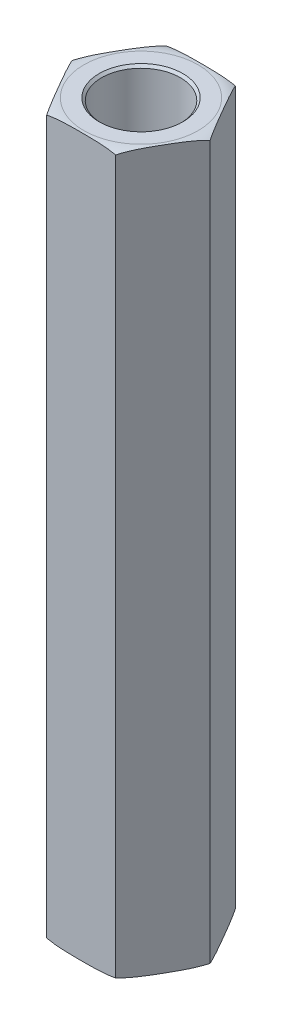
ISO-10303-21;
HEADER;
FILE_DESCRIPTION(('STEP AP214'),'2;1');
FILE_NAME('part.step','',(''),(''),'','','');
FILE_SCHEMA(('AUTOMOTIVE_DESIGN { 1 0 10303 214 1 1 1 1 }'));
ENDSEC;
DATA;
#1=APPLICATION_CONTEXT('core data for automotive mechanical design processes');
#2=APPLICATION_PROTOCOL_DEFINITION('international standard','automotive_design',2000,#1);
#3=PRODUCT_CONTEXT('',#1,'mechanical');
#4=PRODUCT('Part','Part','',(#3));
#5=PRODUCT_RELATED_PRODUCT_CATEGORY('part','',(#4));
#6=PRODUCT_DEFINITION_FORMATION('','',#4);
#7=PRODUCT_DEFINITION_CONTEXT('part definition',#1,'design');
#8=PRODUCT_DEFINITION('design','',#6,#7);
#9=PRODUCT_DEFINITION_SHAPE('','',#8);
#10=(LENGTH_UNIT() NAMED_UNIT(*) SI_UNIT(.MILLI.,.METRE.));
#11=(NAMED_UNIT(*) PLANE_ANGLE_UNIT() SI_UNIT($,.RADIAN.));
#12=(NAMED_UNIT(*) SI_UNIT($,.STERADIAN.) SOLID_ANGLE_UNIT());
#13=UNCERTAINTY_MEASURE_WITH_UNIT(LENGTH_MEASURE(1.E-05),#10,'distance_accuracy_value','');
#14=(GEOMETRIC_REPRESENTATION_CONTEXT(3) GLOBAL_UNCERTAINTY_ASSIGNED_CONTEXT((#13)) GLOBAL_UNIT_ASSIGNED_CONTEXT((#10,
#11,#12)) REPRESENTATION_CONTEXT('',''));
#15=CARTESIAN_POINT('',(0.,0.,0.));
#16=DIRECTION('',(0.,0.,1.));
#17=DIRECTION('',(1.,0.,0.));
#18=AXIS2_PLACEMENT_3D('',#15,#16,#17);
#19=CARTESIAN_POINT('',(0.,6.35,0.));
#20=DIRECTION('',(0.,1.,0.));
#21=DIRECTION('',(0.,0.,1.));
#22=AXIS2_PLACEMENT_3D('',#19,#20,#21);
#23=PLANE('',#22);
#24=CARTESIAN_POINT('',(0.,6.35,0.));
#25=DIRECTION('',(0.,1.,0.));
#26=DIRECTION('',(0.,0.,1.));
#27=AXIS2_PLACEMENT_3D('',#24,#25,#26);
#28=CIRCLE('',#27,2.0955);
#29=CARTESIAN_POINT('',(0.,6.35,2.0955));
#30=VERTEX_POINT('',#29);
#31=EDGE_CURVE('E476',#30,#30,#28,.T.);
#32=ORIENTED_EDGE('',*,*,#31,.T.);
#33=EDGE_LOOP('',(#32));
#34=FACE_BOUND('',#33,.T.);
#35=ADVANCED_FACE('F16',(#34),#23,.T.);
#36=CARTESIAN_POINT('',(0.,-6.35,0.));
#37=DIRECTION('',(0.,-1.,0.));
#38=DIRECTION('',(0.,0.,-1.));
#39=AXIS2_PLACEMENT_3D('',#36,#37,#38);
#40=PLANE('',#39);
#41=CARTESIAN_POINT('',(0.,-6.35,0.));
#42=DIRECTION('',(0.,-1.,0.));
#43=DIRECTION('',(0.,0.,-1.));
#44=AXIS2_PLACEMENT_3D('',#41,#42,#43);
#45=CIRCLE('',#44,2.0955);
#46=CARTESIAN_POINT('',(0.,-6.35,-2.0955));
#47=VERTEX_POINT('',#46);
#48=EDGE_CURVE('E132',#47,#47,#45,.T.);
#49=ORIENTED_EDGE('',*,*,#48,.T.);
#50=EDGE_LOOP('',(#49));
#51=FACE_BOUND('',#50,.T.);
#52=ADVANCED_FACE('F416',(#51),#40,.T.);
#53=CARTESIAN_POINT('',(0.,6.35,0.));
#54=DIRECTION('',(0.,1.,0.));
#55=DIRECTION('',(0.,0.,1.));
#56=AXIS2_PLACEMENT_3D('',#53,#54,#55);
#57=CYLINDRICAL_SURFACE('',#56,2.0955);
#58=CARTESIAN_POINT('',(0.,18.9229999999725,0.));
#59=DIRECTION('',(0.,1.,0.));
#60=DIRECTION('',(0.,0.,1.));
#61=AXIS2_PLACEMENT_3D('',#58,#59,#60);
#62=CIRCLE('',#61,2.09549999999581);
#63=CARTESIAN_POINT('',(0.,18.9229999999725,2.09549999999581));
#64=VERTEX_POINT('',#63);
#65=EDGE_CURVE('E130',#64,#64,#62,.T.);
#66=ORIENTED_EDGE('',*,*,#65,.T.);
#67=EDGE_LOOP('',(#66));
#68=FACE_BOUND('',#67,.T.);
#69=ORIENTED_EDGE('',*,*,#31,.F.);
#70=EDGE_LOOP('',(#69));
#71=FACE_BOUND('',#70,.T.);
#72=ADVANCED_FACE('F407',(#68,#71),#57,.F.);
#73=CARTESIAN_POINT('',(0.,-6.35,0.));
#74=DIRECTION('',(0.,-1.,0.));
#75=DIRECTION('',(0.,0.,-1.));
#76=AXIS2_PLACEMENT_3D('',#73,#74,#75);
#77=CYLINDRICAL_SURFACE('',#76,2.0955);
#78=ORIENTED_EDGE('',*,*,#48,.F.);
#79=EDGE_LOOP('',(#78));
#80=FACE_BOUND('',#79,.T.);
#81=CARTESIAN_POINT('',(0.,-18.9229999999725,0.));
#82=DIRECTION('',(0.,-1.,0.));
#83=DIRECTION('',(0.,0.,-1.));
#84=AXIS2_PLACEMENT_3D('',#81,#82,#83);
#85=CIRCLE('',#84,2.09550000005265);
#86=CARTESIAN_POINT('',(0.,-18.9229999999725,-2.09550000005265));
#87=VERTEX_POINT('',#86);
#88=EDGE_CURVE('E92',#87,#87,#85,.T.);
#89=ORIENTED_EDGE('',*,*,#88,.T.);
#90=EDGE_LOOP('',(#89));
#91=FACE_BOUND('',#90,.T.);
#92=ADVANCED_FACE('F398',(#80,#91),#77,.F.);
#93=CARTESIAN_POINT('',(0.,19.0499999999361,0.));
#94=DIRECTION('',(0.,1.,0.));
#95=DIRECTION('',(0.,0.,1.));
#96=AXIS2_PLACEMENT_3D('',#93,#94,#95);
#97=CONICAL_SURFACE('',#96,2.22249999995938,0.785398163397448);
#98=CARTESIAN_POINT('',(0.,19.0499999999929,0.));
#99=DIRECTION('',(0.,1.,0.));
#100=DIRECTION('',(0.,0.,1.));
#101=AXIS2_PLACEMENT_3D('',#98,#99,#100);
#102=CIRCLE('',#101,2.22250000001623);
#103=CARTESIAN_POINT('',(0.,19.0499999999929,2.22250000001623));
#104=VERTEX_POINT('',#103);
#105=EDGE_CURVE('E212',#104,#104,#102,.T.);
#106=ORIENTED_EDGE('',*,*,#105,.T.);
#107=EDGE_LOOP('',(#106));
#108=FACE_BOUND('',#107,.T.);
#109=ORIENTED_EDGE('',*,*,#65,.F.);
#110=EDGE_LOOP('',(#109));
#111=FACE_BOUND('',#110,.T.);
#112=ADVANCED_FACE('F390',(#108,#111),#97,.F.);
#113=CARTESIAN_POINT('',(0.,-19.0499999999361,0.));
#114=DIRECTION('',(0.,-1.,0.));
#115=DIRECTION('',(0.,0.,-1.));
#116=AXIS2_PLACEMENT_3D('',#113,#114,#115);
#117=CONICAL_SURFACE('',#116,2.22250000001623,0.785398163397448);
#118=ORIENTED_EDGE('',*,*,#88,.F.);
#119=EDGE_LOOP('',(#118));
#120=FACE_BOUND('',#119,.T.);
#121=CARTESIAN_POINT('',(0.,-19.0499999999361,0.));
#122=DIRECTION('',(0.,-1.,0.));
#123=DIRECTION('',(0.,0.,-1.));
#124=AXIS2_PLACEMENT_3D('',#121,#122,#123);
#125=CIRCLE('',#124,2.22250000001623);
#126=CARTESIAN_POINT('',(0.,-19.0499999999361,-2.22250000001623));
#127=VERTEX_POINT('',#126);
#128=EDGE_CURVE('E207',#127,#127,#125,.F.);
#129=ORIENTED_EDGE('',*,*,#128,.F.);
#130=EDGE_LOOP('',(#129));
#131=FACE_BOUND('',#130,.T.);
#132=ADVANCED_FACE('F383',(#120,#131),#117,.F.);
#133=CARTESIAN_POINT('',(1.83308710467706,19.05,3.17499999999999));
#134=DIRECTION('',(-0.866025403784439,0.,-0.5));
#135=DIRECTION('',(-0.5,0.,0.866025403784439));
#136=AXIS2_PLACEMENT_3D('',#133,#134,#135);
#137=PLANE('',#136);
#138=DIRECTION('',(0.,1.,0.));
#139=VECTOR('',#138,1.);
#140=CARTESIAN_POINT('',(3.66617420935412,19.05,0.));
#141=LINE('',#140,#139);
#142=CARTESIAN_POINT('',(3.66617420935412,-18.923,0.));
#143=VERTEX_POINT('',#142);
#144=CARTESIAN_POINT('',(3.66617420935412,18.923,0.));
#145=VERTEX_POINT('',#144);
#146=EDGE_CURVE('E74',#143,#145,#141,.T.);
#147=ORIENTED_EDGE('',*,*,#146,.T.);
#148=CARTESIAN_POINT('',(1.83308710467706,18.923,3.17499999999999));
#149=CARTESIAN_POINT('',(1.87128169935724,18.9389014148997,3.10884502143943));
#150=CARTESIAN_POINT('',(1.90969320538962,18.9524886076105,3.04231434139611));
#151=CARTESIAN_POINT('',(1.98677079607408,18.9758161979402,2.90881203820562));
#152=CARTESIAN_POINT('',(2.02543658353273,18.9855604771397,2.84184092981258));
#153=CARTESIAN_POINT('',(2.10284499535247,19.0019966530451,2.70776562760758));
#154=CARTESIAN_POINT('',(2.14158731769808,19.0086945328669,2.64066195690178));
#155=CARTESIAN_POINT('',(2.21916296783007,19.0197767572932,2.50629698944297));
#156=CARTESIAN_POINT('',(2.2579963181535,19.024160450474,2.43903565365468));
#157=CARTESIAN_POINT('',(2.33572065438806,19.0312403004263,2.30441315431184));
#158=CARTESIAN_POINT('',(2.37461166028646,19.0339355237591,2.23705195613837));
#159=CARTESIAN_POINT('',(2.45240986808529,19.0381531983713,2.10230150749298));
#160=CARTESIAN_POINT('',(2.49131707051153,19.0396756080272,2.03491225611037));
#161=CARTESIAN_POINT('',(2.5687461380425,19.041922705889,1.90080117716405));
#162=CARTESIAN_POINT('',(2.60726795154189,19.0426552468181,1.83407943898342));
#163=CARTESIAN_POINT('',(2.6843135305698,19.0435767302574,1.70063258160851));
#164=CARTESIAN_POINT('',(2.72283729611684,19.0437656658949,1.63390746238215));
#165=CARTESIAN_POINT('',(2.79990166972112,19.0436659966806,1.50042805184608));
#166=CARTESIAN_POINT('',(2.83844227771303,19.0433771811766,1.4336737606495));
#167=CARTESIAN_POINT('',(2.91552223317795,19.042221986219,1.30016736153911));
#168=CARTESIAN_POINT('',(2.9540615806188,19.0413555970386,1.23341525368101));
#169=CARTESIAN_POINT('',(3.03113161773355,19.0387861940656,1.09992603365704));
#170=CARTESIAN_POINT('',(3.06966230777161,19.0370832271617,1.03318892086044));
#171=CARTESIAN_POINT('',(3.14670480062218,19.0324387229726,0.899747408901487));
#172=CARTESIAN_POINT('',(3.18521660427684,19.0294972471358,0.833043008280498));
#173=CARTESIAN_POINT('',(3.24841925163182,19.0232174124749,0.72357281188882));
#174=CARTESIAN_POINT('',(3.27312282066116,19.0203980110463,0.680784975201713));
#175=CARTESIAN_POINT('',(3.32249186130897,19.0138696794304,0.595275288478771));
#176=CARTESIAN_POINT('',(3.34715734368941,19.0101610809139,0.552553419802656));
#177=CARTESIAN_POINT('',(3.39643377591427,19.0016802711497,0.467204135573464));
#178=CARTESIAN_POINT('',(3.42104474295594,18.9969084657008,0.424576690233898));
#179=CARTESIAN_POINT('',(3.47026036719572,18.9860987712516,0.339332728524376));
#180=CARTESIAN_POINT('',(3.49486485317658,18.9800577313084,0.296716508711413));
#181=CARTESIAN_POINT('',(3.54398805502187,18.9665138354161,0.21163262728491));
#182=CARTESIAN_POINT('',(3.56850671785506,18.959010197803,0.169165057524178));
#183=CARTESIAN_POINT('',(3.61743974029948,18.9423203507084,0.0844105764825355));
#184=CARTESIAN_POINT('',(3.64185387349849,18.9331314978033,0.0421240573590955));
#185=CARTESIAN_POINT('',(3.66617420935412,18.923,0.));
#186=B_SPLINE_CURVE_WITH_KNOTS('',3,(#148,#149,#150,#151,#152,#153,#154,#155,#156,#157,#158,
#159,#160,#161,#162,#163,#164,#165,#166,#167,#168,#169,#170,#171,#172,#173,#174,#175,#176,#177,
#178,#179,#180,#181,#182,#183,#184,#185),.UNSPECIFIED.,.F.,.F.,(4,2,2,2,2,2,2,2,2,2,2,2,2,2,2,2,
2,2,4),(0.,0.233977307817955,0.46771767504072,0.700996973557539,0.934341903229802,
1.16781571967246,1.40129782179832,1.63243665809679,1.86357841666627,2.09482211846306,
2.32606971471508,2.55730435147412,2.78852751694429,2.936983692651,3.08538458004484,
3.23372892334592,3.38244598546617,3.53124274626086,3.68027493713584),.UNSPECIFIED.);
#187=CARTESIAN_POINT('',(1.83308710467706,18.923,3.17499999999999));
#188=VERTEX_POINT('',#187);
#189=EDGE_CURVE('E98',#188,#145,#186,.T.);
#190=ORIENTED_EDGE('',*,*,#189,.F.);
#191=DIRECTION('',(0.,1.,0.));
#192=VECTOR('',#191,1.);
#193=CARTESIAN_POINT('',(1.83308710467707,19.05,3.17499999999999));
#194=LINE('',#193,#192);
#195=CARTESIAN_POINT('',(1.83308710467706,-18.923,3.17499999999999));
#196=VERTEX_POINT('',#195);
#197=EDGE_CURVE('E91',#188,#196,#194,.F.);
#198=ORIENTED_EDGE('',*,*,#197,.T.);
#199=CARTESIAN_POINT('',(3.66617420935412,-18.923,0.));
#200=CARTESIAN_POINT('',(3.62797961467394,-18.9389014148997,0.0661549785605664));
#201=CARTESIAN_POINT('',(3.58956810864156,-18.9524886076105,0.132685658603887));
#202=CARTESIAN_POINT('',(3.5124905179571,-18.9758161979402,0.266187961794378));
#203=CARTESIAN_POINT('',(3.47382473049845,-18.9855604771397,0.333159070187413));
#204=CARTESIAN_POINT('',(3.39641631867871,-19.0019966530451,0.467234372392412));
#205=CARTESIAN_POINT('',(3.3576739963331,-19.0086945328669,0.53433804309822));
#206=CARTESIAN_POINT('',(3.28009834620111,-19.0197767572932,0.668703010557026));
#207=CARTESIAN_POINT('',(3.24126499587768,-19.024160450474,0.735964346345317));
#208=CARTESIAN_POINT('',(3.16354065964312,-19.0312403004263,0.870586845688155));
#209=CARTESIAN_POINT('',(3.12464965374472,-19.0339355237591,0.937948043861631));
#210=CARTESIAN_POINT('',(3.04685144594589,-19.0381531983713,1.07269849250702));
#211=CARTESIAN_POINT('',(3.00794424351965,-19.0396756080272,1.14008774388963));
#212=CARTESIAN_POINT('',(2.93051517598868,-19.041922705889,1.27419882283594));
#213=CARTESIAN_POINT('',(2.89199336248929,-19.0426552468181,1.34092056101658));
#214=CARTESIAN_POINT('',(2.81494778346138,-19.0435767302574,1.47436741839149));
#215=CARTESIAN_POINT('',(2.77642401791434,-19.0437656658949,1.54109253761784));
#216=CARTESIAN_POINT('',(2.69935964431006,-19.0436659966806,1.67457194815391));
#217=CARTESIAN_POINT('',(2.66081903631815,-19.0433771811766,1.7413262393505));
#218=CARTESIAN_POINT('',(2.58373908085323,-19.042221986219,1.87483263846089));
#219=CARTESIAN_POINT('',(2.54519973341238,-19.0413555970386,1.94158474631899));
#220=CARTESIAN_POINT('',(2.46812969629763,-19.0387861940656,2.07507396634296));
#221=CARTESIAN_POINT('',(2.42959900625957,-19.0370832271617,2.14181107913956));
#222=CARTESIAN_POINT('',(2.352556513409,-19.0324387229726,2.27525259109851));
#223=CARTESIAN_POINT('',(2.31404470975434,-19.0294972471358,2.3419569917195));
#224=CARTESIAN_POINT('',(2.25084206239936,-19.0232174124749,2.45142718811118));
#225=CARTESIAN_POINT('',(2.22613849337002,-19.0203980110463,2.49421502479828));
#226=CARTESIAN_POINT('',(2.17676945272221,-19.0138696794304,2.57972471152123));
#227=CARTESIAN_POINT('',(2.15210397034177,-19.0101610809139,2.62244658019734));
#228=CARTESIAN_POINT('',(2.10282753811691,-19.0016802711497,2.70779586442653));
#229=CARTESIAN_POINT('',(2.07821657107524,-18.9969084657008,2.7504233097661));
#230=CARTESIAN_POINT('',(2.02900094683546,-18.9860987712516,2.83566727147562));
#231=CARTESIAN_POINT('',(2.0043964608546,-18.9800577313084,2.87828349128858));
#232=CARTESIAN_POINT('',(1.95527325900931,-18.9665138354161,2.96336737271509));
#233=CARTESIAN_POINT('',(1.93075459617612,-18.959010197803,3.00583494247582));
#234=CARTESIAN_POINT('',(1.88182157373171,-18.9423203507084,3.09058942351746));
#235=CARTESIAN_POINT('',(1.8574074405327,-18.9331314978033,3.1328759426409));
#236=CARTESIAN_POINT('',(1.83308710467706,-18.923,3.17499999999999));
#237=B_SPLINE_CURVE_WITH_KNOTS('',3,(#199,#200,#201,#202,#203,#204,#205,#206,#207,#208,#209,
#210,#211,#212,#213,#214,#215,#216,#217,#218,#219,#220,#221,#222,#223,#224,#225,#226,#227,#228,
#229,#230,#231,#232,#233,#234,#235,#236),.UNSPECIFIED.,.F.,.F.,(4,2,2,2,2,2,2,2,2,2,2,2,2,2,2,2,
2,2,4),(0.,0.233977307817955,0.46771767504072,0.70099697355754,0.934341903229803,
1.16781571967246,1.40129782179833,1.63243665809679,1.86357841666628,2.09482211846306,
2.32606971471508,2.55730435147412,2.78852751694429,2.93698369265101,3.08538458004484,
3.23372892334592,3.38244598546617,3.53124274626086,3.68027493713584),.UNSPECIFIED.);
#238=EDGE_CURVE('E85',#143,#196,#237,.T.);
#239=ORIENTED_EDGE('',*,*,#238,.F.);
#240=EDGE_LOOP('',(#147,#190,#198,#239));
#241=FACE_BOUND('',#240,.T.);
#242=ADVANCED_FACE('F89',(#241),#137,.F.);
#243=CARTESIAN_POINT('',(3.66617420935412,19.05,0.));
#244=DIRECTION('',(-0.866025403784439,0.,0.5));
#245=DIRECTION('',(0.5,0.,0.866025403784439));
#246=AXIS2_PLACEMENT_3D('',#243,#244,#245);
#247=PLANE('',#246);
#248=DIRECTION('',(0.,1.,0.));
#249=VECTOR('',#248,1.);
#250=CARTESIAN_POINT('',(1.83308710467706,19.05,-3.175));
#251=LINE('',#250,#249);
#252=CARTESIAN_POINT('',(1.83308710467706,-18.923,-3.175));
#253=VERTEX_POINT('',#252);
#254=CARTESIAN_POINT('',(1.83308710467705,18.923,-3.175));
#255=VERTEX_POINT('',#254);
#256=EDGE_CURVE('E168',#253,#255,#251,.T.);
#257=ORIENTED_EDGE('',*,*,#256,.T.);
#258=CARTESIAN_POINT('',(3.66617420935412,18.923,0.));
#259=CARTESIAN_POINT('',(3.62797961467394,18.9389014148997,-0.0661549785605604));
#260=CARTESIAN_POINT('',(3.58956810864156,18.9524886076105,-0.132685658603881));
#261=CARTESIAN_POINT('',(3.5124905179571,18.9758161979402,-0.266187961794372));
#262=CARTESIAN_POINT('',(3.47382473049845,18.9855604771397,-0.333159070187407));
#263=CARTESIAN_POINT('',(3.39641631867872,19.0019966530451,-0.467234372392405));
#264=CARTESIAN_POINT('',(3.35767399633311,19.0086945328669,-0.534338043098212));
#265=CARTESIAN_POINT('',(3.28009834620111,19.0197767572932,-0.668703010557018));
#266=CARTESIAN_POINT('',(3.24126499587769,19.024160450474,-0.735964346345308));
#267=CARTESIAN_POINT('',(3.16354065964312,19.0312403004263,-0.870586845688146));
#268=CARTESIAN_POINT('',(3.12464965374473,19.0339355237591,-0.937948043861621));
#269=CARTESIAN_POINT('',(3.04685144594589,19.0381531983713,-1.07269849250701));
#270=CARTESIAN_POINT('',(3.00794424351965,19.0396756080272,-1.14008774388962));
#271=CARTESIAN_POINT('',(2.93051517598869,19.041922705889,-1.27419882283593));
#272=CARTESIAN_POINT('',(2.8919933624893,19.0426552468181,-1.34092056101657));
#273=CARTESIAN_POINT('',(2.81494778346139,19.0435767302574,-1.47436741839148));
#274=CARTESIAN_POINT('',(2.77642401791434,19.0437656658949,-1.54109253761783));
#275=CARTESIAN_POINT('',(2.69935964431007,19.0436659966806,-1.6745719481539));
#276=CARTESIAN_POINT('',(2.66081903631816,19.0433771811766,-1.74132623935049));
#277=CARTESIAN_POINT('',(2.58373908085323,19.042221986219,-1.87483263846088));
#278=CARTESIAN_POINT('',(2.54519973341239,19.0413555970386,-1.94158474631897));
#279=CARTESIAN_POINT('',(2.46812969629764,19.0387861940656,-2.07507396634294));
#280=CARTESIAN_POINT('',(2.42959900625958,19.0370832271617,-2.14181107913955));
#281=CARTESIAN_POINT('',(2.35255651340901,19.0324387229726,-2.27525259109849));
#282=CARTESIAN_POINT('',(2.31404470975435,19.0294972471358,-2.34195699171948));
#283=CARTESIAN_POINT('',(2.25084206239937,19.0232174124749,-2.45142718811116));
#284=CARTESIAN_POINT('',(2.22613849337003,19.0203980110463,-2.49421502479827));
#285=CARTESIAN_POINT('',(2.17676945272222,19.0138696794304,-2.57972471152122));
#286=CARTESIAN_POINT('',(2.15210397034178,19.0101610809139,-2.62244658019733));
#287=CARTESIAN_POINT('',(2.10282753811691,19.0016802711497,-2.70779586442653));
#288=CARTESIAN_POINT('',(2.07821657107524,18.9969084657008,-2.75042330976609));
#289=CARTESIAN_POINT('',(2.02900094683546,18.9860987712516,-2.83566727147562));
#290=CARTESIAN_POINT('',(2.0043964608546,18.9800577313084,-2.87828349128858));
#291=CARTESIAN_POINT('',(1.95527325900931,18.9665138354161,-2.96336737271509));
#292=CARTESIAN_POINT('',(1.93075459617612,18.959010197803,-3.00583494247582));
#293=CARTESIAN_POINT('',(1.8818215737317,18.9423203507084,-3.09058942351747));
#294=CARTESIAN_POINT('',(1.85740744053269,18.9331314978033,-3.13287594264091));
#295=CARTESIAN_POINT('',(1.83308710467705,18.923,-3.175));
#296=B_SPLINE_CURVE_WITH_KNOTS('',3,(#258,#259,#260,#261,#262,#263,#264,#265,#266,#267,#268,
#269,#270,#271,#272,#273,#274,#275,#276,#277,#278,#279,#280,#281,#282,#283,#284,#285,#286,#287,
#288,#289,#290,#291,#292,#293,#294,#295),.UNSPECIFIED.,.F.,.F.,(4,2,2,2,2,2,2,2,2,2,2,2,2,2,2,2,
2,2,4),(0.,0.233977307817954,0.467717675040719,0.700996973557537,0.934341903229799,
1.16781571967246,1.40129782179832,1.63243665809678,1.86357841666627,2.09482211846305,
2.32606971471507,2.55730435147411,2.78852751694428,2.936983692651,3.08538458004484,
3.23372892334592,3.38244598546618,3.53124274626087,3.68027493713586),.UNSPECIFIED.);
#297=EDGE_CURVE('E82',#145,#255,#296,.T.);
#298=ORIENTED_EDGE('',*,*,#297,.F.);
#299=ORIENTED_EDGE('',*,*,#146,.F.);
#300=CARTESIAN_POINT('',(1.83308710467706,-18.923,-3.175));
#301=CARTESIAN_POINT('',(1.87128169935723,-18.9389014148997,-3.10884502143944));
#302=CARTESIAN_POINT('',(1.90969320538961,-18.9524886076105,-3.04231434139612));
#303=CARTESIAN_POINT('',(1.98677079607408,-18.9758161979402,-2.90881203820563));
#304=CARTESIAN_POINT('',(2.02543658353272,-18.9855604771397,-2.84184092981259));
#305=CARTESIAN_POINT('',(2.10284499535246,-19.0019966530451,-2.70776562760759));
#306=CARTESIAN_POINT('',(2.14158731769807,-19.0086945328669,-2.64066195690179));
#307=CARTESIAN_POINT('',(2.21916296783006,-19.0197767572932,-2.50629698944298));
#308=CARTESIAN_POINT('',(2.25799631815349,-19.024160450474,-2.43903565365469));
#309=CARTESIAN_POINT('',(2.33572065438805,-19.0312403004263,-2.30441315431186));
#310=CARTESIAN_POINT('',(2.37461166028645,-19.0339355237591,-2.23705195613838));
#311=CARTESIAN_POINT('',(2.45240986808528,-19.0381531983713,-2.102301507493));
#312=CARTESIAN_POINT('',(2.49131707051152,-19.0396756080272,-2.03491225611039));
#313=CARTESIAN_POINT('',(2.56874613804248,-19.041922705889,-1.90080117716407));
#314=CARTESIAN_POINT('',(2.60726795154187,-19.0426552468181,-1.83407943898344));
#315=CARTESIAN_POINT('',(2.68431353056979,-19.0435767302574,-1.70063258160853));
#316=CARTESIAN_POINT('',(2.72283729611683,-19.0437656658949,-1.63390746238217));
#317=CARTESIAN_POINT('',(2.7999016697211,-19.0436659966806,-1.50042805184611));
#318=CARTESIAN_POINT('',(2.83844227771302,-19.0433771811766,-1.43367376064952));
#319=CARTESIAN_POINT('',(2.91552223317794,-19.042221986219,-1.30016736153913));
#320=CARTESIAN_POINT('',(2.95406158061878,-19.0413555970386,-1.23341525368103));
#321=CARTESIAN_POINT('',(3.03113161773353,-19.0387861940656,-1.09992603365707));
#322=CARTESIAN_POINT('',(3.06966230777159,-19.0370832271617,-1.03318892086046));
#323=CARTESIAN_POINT('',(3.14670480062216,-19.0324387229726,-0.899747408901513));
#324=CARTESIAN_POINT('',(3.18521660427682,-19.0294972471358,-0.833043008280524));
#325=CARTESIAN_POINT('',(3.2484192516318,-19.0232174124749,-0.723572811888844));
#326=CARTESIAN_POINT('',(3.27312282066114,-19.0203980110463,-0.680784975201736));
#327=CARTESIAN_POINT('',(3.32249186130896,-19.0138696794304,-0.59527528847879));
#328=CARTESIAN_POINT('',(3.3471573436894,-19.0101610809139,-0.552553419802673));
#329=CARTESIAN_POINT('',(3.39643377591426,-19.0016802711497,-0.467204135573478));
#330=CARTESIAN_POINT('',(3.42104474295593,-18.9969084657008,-0.42457669023391));
#331=CARTESIAN_POINT('',(3.47026036719571,-18.9860987712516,-0.339332728524384));
#332=CARTESIAN_POINT('',(3.49486485317657,-18.9800577313084,-0.29671650871142));
#333=CARTESIAN_POINT('',(3.54398805502186,-18.9665138354161,-0.211632627284913));
#334=CARTESIAN_POINT('',(3.56850671785505,-18.959010197803,-0.169165057524178));
#335=CARTESIAN_POINT('',(3.61743974029948,-18.9423203507084,-0.0844105764825321));
#336=CARTESIAN_POINT('',(3.64185387349849,-18.9331314978033,-0.0421240573590899));
#337=CARTESIAN_POINT('',(3.66617420935412,-18.923,0.));
#338=B_SPLINE_CURVE_WITH_KNOTS('',3,(#300,#301,#302,#303,#304,#305,#306,#307,#308,#309,#310,
#311,#312,#313,#314,#315,#316,#317,#318,#319,#320,#321,#322,#323,#324,#325,#326,#327,#328,#329,
#330,#331,#332,#333,#334,#335,#336,#337),.UNSPECIFIED.,.F.,.F.,(4,2,2,2,2,2,2,2,2,2,2,2,2,2,2,2,
2,2,4),(0.,0.233977307817952,0.467717675040715,0.700996973557533,0.934341903229794,
1.16781571967245,1.40129782179831,1.63243665809677,1.86357841666626,2.09482211846304,
2.32606971471506,2.5573043514741,2.78852751694426,2.93698369265099,3.08538458004483,
3.23372892334591,3.38244598546617,3.53124274626087,3.68027493713585),.UNSPECIFIED.);
#339=EDGE_CURVE('E79',#253,#143,#338,.T.);
#340=ORIENTED_EDGE('',*,*,#339,.F.);
#341=EDGE_LOOP('',(#257,#298,#299,#340));
#342=FACE_BOUND('',#341,.T.);
#343=ADVANCED_FACE('F77',(#342),#247,.F.);
#344=CARTESIAN_POINT('',(-1.83308710467707,19.05,-3.175));
#345=DIRECTION('',(0.,-1.,0.));
#346=DIRECTION('',(0.,0.,-1.));
#347=AXIS2_PLACEMENT_3D('',#344,#345,#346);
#348=PLANE('',#347);
#349=CARTESIAN_POINT('',(0.,19.05,0.));
#350=DIRECTION('',(0.,-1.,0.));
#351=DIRECTION('',(0.,0.,1.));
#352=AXIS2_PLACEMENT_3D('',#349,#350,#351);
#353=CIRCLE('',#352,3.03117420935412);
#354=CARTESIAN_POINT('',(0.,19.05,3.03117420935412));
#355=VERTEX_POINT('',#354);
#356=CARTESIAN_POINT('',(0.,19.05,-3.03117420935412));
#357=VERTEX_POINT('',#356);
#358=EDGE_CURVE('E249',#355,#357,#353,.T.);
#359=ORIENTED_EDGE('',*,*,#358,.F.);
#360=CARTESIAN_POINT('',(0.,19.05,0.));
#361=DIRECTION('',(0.,-1.,0.));
#362=DIRECTION('',(0.,0.,-1.));
#363=AXIS2_PLACEMENT_3D('',#360,#361,#362);
#364=CIRCLE('',#363,3.03117420935412);
#365=EDGE_CURVE('E211',#357,#355,#364,.T.);
#366=ORIENTED_EDGE('',*,*,#365,.F.);
#367=EDGE_LOOP('',(#359,#366));
#368=FACE_BOUND('',#367,.T.);
#369=ORIENTED_EDGE('',*,*,#105,.F.);
#370=EDGE_LOOP('',(#369));
#371=FACE_BOUND('',#370,.T.);
#372=ADVANCED_FACE('F220',(#368,#371),#348,.F.);
#373=CARTESIAN_POINT('',(-1.83308710467707,-19.05,-3.175));
#374=DIRECTION('',(0.,-1.,0.));
#375=DIRECTION('',(0.,0.,-1.));
#376=AXIS2_PLACEMENT_3D('',#373,#374,#375);
#377=PLANE('',#376);
#378=CARTESIAN_POINT('',(0.,-19.05,0.));
#379=DIRECTION('',(0.,1.,0.));
#380=DIRECTION('',(0.,0.,1.));
#381=AXIS2_PLACEMENT_3D('',#378,#379,#380);
#382=CIRCLE('',#381,3.03117420935412);
#383=CARTESIAN_POINT('',(0.,-19.05,-3.03117420935412));
#384=VERTEX_POINT('',#383);
#385=CARTESIAN_POINT('',(0.,-19.05,3.03117420935412));
#386=VERTEX_POINT('',#385);
#387=EDGE_CURVE('E210',#384,#386,#382,.F.);
#388=ORIENTED_EDGE('',*,*,#387,.T.);
#389=CARTESIAN_POINT('',(0.,-19.05,0.));
#390=DIRECTION('',(0.,1.,0.));
#391=DIRECTION('',(0.,0.,-1.));
#392=AXIS2_PLACEMENT_3D('',#389,#390,#391);
#393=CIRCLE('',#392,3.03117420935412);
#394=EDGE_CURVE('E276',#384,#386,#393,.T.);
#395=ORIENTED_EDGE('',*,*,#394,.F.);
#396=EDGE_LOOP('',(#388,#395));
#397=FACE_BOUND('',#396,.T.);
#398=ORIENTED_EDGE('',*,*,#128,.T.);
#399=EDGE_LOOP('',(#398));
#400=FACE_BOUND('',#399,.T.);
#401=ADVANCED_FACE('F226',(#397,#400),#377,.T.);
#402=CARTESIAN_POINT('',(-1.83308710467707,19.05,3.175));
#403=DIRECTION('',(0.,0.,-1.));
#404=DIRECTION('',(-1.,0.,0.));
#405=AXIS2_PLACEMENT_3D('',#402,#403,#404);
#406=PLANE('',#405);
#407=ORIENTED_EDGE('',*,*,#197,.F.);
#408=CARTESIAN_POINT('',(-1.83308710467706,18.923,3.175));
#409=CARTESIAN_POINT('',(-1.73237579828683,18.9439400141518,3.175));
#410=CARTESIAN_POINT('',(-1.63096506893486,18.9608853495327,3.175));
#411=CARTESIAN_POINT('',(-1.42767146651469,18.9884971643984,3.175));
#412=CARTESIAN_POINT('',(-1.32579191427254,18.9991875658753,3.175));
#413=CARTESIAN_POINT('',(-1.12177634709138,19.0161280408079,3.175));
#414=CARTESIAN_POINT('',(-1.0196405664338,19.0223812707189,3.175));
#415=CARTESIAN_POINT('',(-0.815663681397376,19.0319028064183,3.175));
#416=CARTESIAN_POINT('',(-0.713823115514574,19.0351834044999,3.175));
#417=CARTESIAN_POINT('',(-0.510018485441651,19.0399454848703,3.175));
#418=CARTESIAN_POINT('',(-0.408054390577977,19.0414254100882,3.175));
#419=CARTESIAN_POINT('',(-0.20406020033787,19.0433146818379,3.175));
#420=CARTESIAN_POINT('',(-0.102030100168935,19.0437234241492,3.175));
#421=CARTESIAN_POINT('',(0.102030100168936,19.0437234241492,3.175));
#422=CARTESIAN_POINT('',(0.204060200337871,19.0433146818379,3.17499999999999));
#423=CARTESIAN_POINT('',(0.408054390577978,19.0414254100882,3.17499999999999));
#424=CARTESIAN_POINT('',(0.510018485441653,19.0399454848703,3.17499999999999));
#425=CARTESIAN_POINT('',(0.713823115514576,19.0351834044999,3.17499999999999));
#426=CARTESIAN_POINT('',(0.815663681397379,19.0319028064183,3.17499999999999));
#427=CARTESIAN_POINT('',(1.0196405664338,19.0223812707189,3.17499999999999));
#428=CARTESIAN_POINT('',(1.12177634709138,19.0161280408079,3.17499999999999));
#429=CARTESIAN_POINT('',(1.32579191427255,18.9991875658753,3.17499999999999));
#430=CARTESIAN_POINT('',(1.4276714665147,18.9884971643984,3.17499999999999));
#431=CARTESIAN_POINT('',(1.63096506893487,18.9608853495327,3.17499999999999));
#432=CARTESIAN_POINT('',(1.73237579828684,18.9439400141518,3.17499999999999));
#433=CARTESIAN_POINT('',(1.83308710467707,18.923,3.17499999999999));
#434=B_SPLINE_CURVE_WITH_KNOTS('',3,(#408,#409,#410,#411,#412,#413,#414,#415,#416,#417,#418,
#419,#420,#421,#422,#423,#424,#425,#426,#427,#428,#429,#430,#431,#432,#433),.UNSPECIFIED.,.F.,
.F.,(4,2,2,2,2,2,2,2,2,2,2,2,4),(0.,0.308333242342808,0.615479423308235,0.92240689113001,
1.2280592962085,1.53397581645216,1.84006485747889,2.14615389850562,2.45207041874928,
2.75772282382777,3.06465029164955,3.37179647261498,3.68012971495778),.UNSPECIFIED.);
#435=CARTESIAN_POINT('',(-1.83308710467706,18.923,3.175));
#436=VERTEX_POINT('',#435);
#437=EDGE_CURVE('E195',#436,#188,#434,.T.);
#438=ORIENTED_EDGE('',*,*,#437,.F.);
#439=DIRECTION('',(0.,1.,0.));
#440=VECTOR('',#439,1.);
#441=CARTESIAN_POINT('',(-1.83308710467707,19.05,3.175));
#442=LINE('',#441,#440);
#443=CARTESIAN_POINT('',(-1.83308710467708,-18.923,3.17499999999999));
#444=VERTEX_POINT('',#443);
#445=EDGE_CURVE('E162',#436,#444,#442,.F.);
#446=ORIENTED_EDGE('',*,*,#445,.T.);
#447=CARTESIAN_POINT('',(1.83308710467706,-18.923,3.17499999999999));
#448=CARTESIAN_POINT('',(1.73237579828684,-18.9439400141518,3.17499999999999));
#449=CARTESIAN_POINT('',(1.63096506893486,-18.9608853495327,3.17499999999999));
#450=CARTESIAN_POINT('',(1.4276714665147,-18.9884971643984,3.17499999999999));
#451=CARTESIAN_POINT('',(1.32579191427254,-18.9991875658753,3.17499999999999));
#452=CARTESIAN_POINT('',(1.12177634709138,-19.0161280408079,3.17499999999999));
#453=CARTESIAN_POINT('',(1.0196405664338,-19.0223812707189,3.17499999999999));
#454=CARTESIAN_POINT('',(0.815663681397379,-19.0319028064183,3.17499999999999));
#455=CARTESIAN_POINT('',(0.713823115514576,-19.0351834044999,3.17499999999999));
#456=CARTESIAN_POINT('',(0.510018485441653,-19.0399454848703,3.17499999999999));
#457=CARTESIAN_POINT('',(0.408054390577978,-19.0414254100882,3.17499999999999));
#458=CARTESIAN_POINT('',(0.204060200337871,-19.0433146818379,3.17499999999999));
#459=CARTESIAN_POINT('',(0.102030100168935,-19.0437234241492,3.175));
#460=CARTESIAN_POINT('',(-0.102030100168936,-19.0437234241492,3.175));
#461=CARTESIAN_POINT('',(-0.204060200337872,-19.0433146818379,3.175));
#462=CARTESIAN_POINT('',(-0.408054390577981,-19.0414254100882,3.175));
#463=CARTESIAN_POINT('',(-0.510018485441656,-19.0399454848703,3.175));
#464=CARTESIAN_POINT('',(-0.713823115514581,-19.0351834044999,3.175));
#465=CARTESIAN_POINT('',(-0.815663681397384,-19.0319028064183,3.175));
#466=CARTESIAN_POINT('',(-1.01964056643381,-19.0223812707189,3.175));
#467=CARTESIAN_POINT('',(-1.12177634709139,-19.0161280408079,3.175));
#468=CARTESIAN_POINT('',(-1.32579191427255,-18.9991875658753,3.175));
#469=CARTESIAN_POINT('',(-1.42767146651471,-18.9884971643984,3.175));
#470=CARTESIAN_POINT('',(-1.63096506893487,-18.9608853495327,3.175));
#471=CARTESIAN_POINT('',(-1.73237579828685,-18.9439400141518,3.175));
#472=CARTESIAN_POINT('',(-1.83308710467708,-18.923,3.175));
#473=B_SPLINE_CURVE_WITH_KNOTS('',3,(#447,#448,#449,#450,#451,#452,#453,#454,#455,#456,#457,
#458,#459,#460,#461,#462,#463,#464,#465,#466,#467,#468,#469,#470,#471,#472),.UNSPECIFIED.,.F.,
.F.,(4,2,2,2,2,2,2,2,2,2,2,2,4),(0.,0.308333242342808,0.615479423308237,0.922406891130012,
1.22805929620851,1.53397581645217,1.84006485747889,2.14615389850562,2.45207041874929,
2.75772282382778,3.06465029164956,3.37179647261499,3.6801297149578),.UNSPECIFIED.);
#474=EDGE_CURVE('E259',#196,#444,#473,.T.);
#475=ORIENTED_EDGE('',*,*,#474,.F.);
#476=EDGE_LOOP('',(#407,#438,#446,#475));
#477=FACE_BOUND('',#476,.T.);
#478=ADVANCED_FACE('F258',(#477),#406,.F.);
#479=CARTESIAN_POINT('',(1.83308710467706,19.05,-3.175));
#480=DIRECTION('',(0.,0.,1.));
#481=DIRECTION('',(1.,0.,0.));
#482=AXIS2_PLACEMENT_3D('',#479,#480,#481);
#483=PLANE('',#482);
#484=DIRECTION('',(0.,1.,0.));
#485=VECTOR('',#484,1.);
#486=CARTESIAN_POINT('',(-1.83308710467708,19.05,-3.17499999999999));
#487=LINE('',#486,#485);
#488=CARTESIAN_POINT('',(-1.83308710467708,-18.923,-3.175));
#489=VERTEX_POINT('',#488);
#490=CARTESIAN_POINT('',(-1.83308710467706,18.923,-3.17500000000001));
#491=VERTEX_POINT('',#490);
#492=EDGE_CURVE('E160',#489,#491,#487,.T.);
#493=ORIENTED_EDGE('',*,*,#492,.T.);
#494=CARTESIAN_POINT('',(1.83308710467705,18.923,-3.175));
#495=CARTESIAN_POINT('',(1.73237579828683,18.9439400141518,-3.175));
#496=CARTESIAN_POINT('',(1.63096506893486,18.9608853495327,-3.175));
#497=CARTESIAN_POINT('',(1.42767146651469,18.9884971643984,-3.175));
#498=CARTESIAN_POINT('',(1.32579191427254,18.9991875658753,-3.175));
#499=CARTESIAN_POINT('',(1.12177634709137,19.0161280408079,-3.175));
#500=CARTESIAN_POINT('',(1.01964056643379,19.0223812707189,-3.175));
#501=CARTESIAN_POINT('',(0.815663681397374,19.0319028064183,-3.175));
#502=CARTESIAN_POINT('',(0.713823115514572,19.0351834044999,-3.175));
#503=CARTESIAN_POINT('',(0.51001848544165,19.0399454848703,-3.175));
#504=CARTESIAN_POINT('',(0.408054390577976,19.0414254100882,-3.175));
#505=CARTESIAN_POINT('',(0.20406020033787,19.0433146818379,-3.175));
#506=CARTESIAN_POINT('',(0.102030100168935,19.0437234241492,-3.175));
#507=CARTESIAN_POINT('',(-0.102030100168934,19.0437234241492,-3.175));
#508=CARTESIAN_POINT('',(-0.204060200337869,19.0433146818379,-3.175));
#509=CARTESIAN_POINT('',(-0.408054390577975,19.0414254100882,-3.175));
#510=CARTESIAN_POINT('',(-0.510018485441649,19.0399454848703,-3.175));
#511=CARTESIAN_POINT('',(-0.71382311551457,19.0351834044999,-3.175));
#512=CARTESIAN_POINT('',(-0.815663681397373,19.0319028064183,-3.175));
#513=CARTESIAN_POINT('',(-1.01964056643379,19.0223812707189,-3.175));
#514=CARTESIAN_POINT('',(-1.12177634709137,19.0161280408079,-3.175));
#515=CARTESIAN_POINT('',(-1.32579191427254,18.9991875658753,-3.175));
#516=CARTESIAN_POINT('',(-1.42767146651469,18.9884971643984,-3.175));
#517=CARTESIAN_POINT('',(-1.63096506893485,18.9608853495327,-3.175));
#518=CARTESIAN_POINT('',(-1.73237579828683,18.9439400141518,-3.175));
#519=CARTESIAN_POINT('',(-1.83308710467705,18.923,-3.175));
#520=B_SPLINE_CURVE_WITH_KNOTS('',3,(#494,#495,#496,#497,#498,#499,#500,#501,#502,#503,#504,
#505,#506,#507,#508,#509,#510,#511,#512,#513,#514,#515,#516,#517,#518,#519),.UNSPECIFIED.,.F.,
.F.,(4,2,2,2,2,2,2,2,2,2,2,2,4),(0.,0.308333242342807,0.615479423308234,0.922406891130008,
1.2280592962085,1.53397581645216,1.84006485747888,2.14615389850561,2.45207041874927,
2.75772282382776,3.06465029164953,3.37179647261496,3.68012971495777),.UNSPECIFIED.);
#521=EDGE_CURVE('E201',#255,#491,#520,.T.);
#522=ORIENTED_EDGE('',*,*,#521,.F.);
#523=ORIENTED_EDGE('',*,*,#256,.F.);
#524=CARTESIAN_POINT('',(-1.83308710467708,-18.923,-3.17500000000001));
#525=CARTESIAN_POINT('',(-1.73237579828685,-18.9439400141518,-3.175));
#526=CARTESIAN_POINT('',(-1.63096506893487,-18.9608853495327,-3.175));
#527=CARTESIAN_POINT('',(-1.4276714665147,-18.9884971643984,-3.175));
#528=CARTESIAN_POINT('',(-1.32579191427255,-18.9991875658753,-3.175));
#529=CARTESIAN_POINT('',(-1.12177634709139,-19.0161280408079,-3.175));
#530=CARTESIAN_POINT('',(-1.01964056643381,-19.0223812707189,-3.175));
#531=CARTESIAN_POINT('',(-0.815663681397384,-19.0319028064183,-3.175));
#532=CARTESIAN_POINT('',(-0.71382311551458,-19.0351834044999,-3.175));
#533=CARTESIAN_POINT('',(-0.510018485441656,-19.0399454848703,-3.175));
#534=CARTESIAN_POINT('',(-0.408054390577981,-19.0414254100882,-3.175));
#535=CARTESIAN_POINT('',(-0.204060200337873,-19.0433146818379,-3.175));
#536=CARTESIAN_POINT('',(-0.102030100168937,-19.0437234241492,-3.175));
#537=CARTESIAN_POINT('',(0.102030100168935,-19.0437234241492,-3.175));
#538=CARTESIAN_POINT('',(0.20406020033787,-19.0433146818379,-3.175));
#539=CARTESIAN_POINT('',(0.408054390577977,-19.0414254100882,-3.175));
#540=CARTESIAN_POINT('',(0.510018485441651,-19.0399454848703,-3.175));
#541=CARTESIAN_POINT('',(0.713823115514573,-19.0351834044999,-3.175));
#542=CARTESIAN_POINT('',(0.815663681397376,-19.0319028064183,-3.175));
#543=CARTESIAN_POINT('',(1.0196405664338,-19.0223812707189,-3.175));
#544=CARTESIAN_POINT('',(1.12177634709138,-19.0161280408079,-3.175));
#545=CARTESIAN_POINT('',(1.32579191427254,-18.9991875658753,-3.175));
#546=CARTESIAN_POINT('',(1.42767146651469,-18.9884971643984,-3.175));
#547=CARTESIAN_POINT('',(1.63096506893486,-18.9608853495327,-3.175));
#548=CARTESIAN_POINT('',(1.73237579828683,-18.9439400141518,-3.175));
#549=CARTESIAN_POINT('',(1.83308710467706,-18.923,-3.17500000000001));
#550=B_SPLINE_CURVE_WITH_KNOTS('',3,(#524,#525,#526,#527,#528,#529,#530,#531,#532,#533,#534,
#535,#536,#537,#538,#539,#540,#541,#542,#543,#544,#545,#546,#547,#548,#549),.UNSPECIFIED.,.F.,
.F.,(4,2,2,2,2,2,2,2,2,2,2,2,4),(0.,0.30833324234281,0.615479423308241,0.922406891130018,
1.22805929620851,1.53397581645217,1.84006485747891,2.14615389850563,2.45207041874929,
2.75772282382779,3.06465029164956,3.37179647261499,3.6801297149578),.UNSPECIFIED.);
#551=EDGE_CURVE('E97',#489,#253,#550,.T.);
#552=ORIENTED_EDGE('',*,*,#551,.F.);
#553=EDGE_LOOP('',(#493,#522,#523,#552));
#554=FACE_BOUND('',#553,.T.);
#555=ADVANCED_FACE('F174',(#554),#483,.F.);
#556=CARTESIAN_POINT('',(0.,17.399,0.));
#557=DIRECTION('',(0.,1.,0.));
#558=DIRECTION('',(0.,0.,1.));
#559=AXIS2_PLACEMENT_3D('',#556,#557,#558);
#560=TOROIDAL_SURFACE('',#559,3.03117420935412,1.65100000000002);
#561=ORIENTED_EDGE('',*,*,#358,.T.);
#562=ORIENTED_EDGE('',*,*,#365,.T.);
#563=EDGE_LOOP('',(#561,#562));
#564=FACE_BOUND('',#563,.T.);
#565=ORIENTED_EDGE('',*,*,#437,.T.);
#566=ORIENTED_EDGE('',*,*,#189,.T.);
#567=ORIENTED_EDGE('',*,*,#297,.T.);
#568=ORIENTED_EDGE('',*,*,#521,.T.);
#569=CARTESIAN_POINT('',(-1.83308710467706,18.923,-3.17500000000001));
#570=CARTESIAN_POINT('',(-1.87128169935724,18.9389014148997,-3.10884502143945));
#571=CARTESIAN_POINT('',(-1.90969320538962,18.9524886076105,-3.04231434139613));
#572=CARTESIAN_POINT('',(-1.98677079607408,18.9758161979402,-2.90881203820564));
#573=CARTESIAN_POINT('',(-2.02543658353272,18.9855604771397,-2.84184092981261));
#574=CARTESIAN_POINT('',(-2.10284499535246,19.0019966530451,-2.70776562760761));
#575=CARTESIAN_POINT('',(-2.14158731769807,19.0086945328669,-2.64066195690181));
#576=CARTESIAN_POINT('',(-2.21916296783006,19.0197767572932,-2.50629698944301));
#577=CARTESIAN_POINT('',(-2.25799631815348,19.024160450474,-2.43903565365472));
#578=CARTESIAN_POINT('',(-2.33572065438805,19.0312403004263,-2.30441315431188));
#579=CARTESIAN_POINT('',(-2.37461166028644,19.0339355237591,-2.23705195613841));
#580=CARTESIAN_POINT('',(-2.45240986808527,19.0381531983713,-2.10230150749303));
#581=CARTESIAN_POINT('',(-2.49131707051151,19.0396756080272,-2.03491225611042));
#582=CARTESIAN_POINT('',(-2.56874613804247,19.041922705889,-1.90080117716411));
#583=CARTESIAN_POINT('',(-2.60726795154186,19.0426552468181,-1.83407943898348));
#584=CARTESIAN_POINT('',(-2.68431353056977,19.0435767302574,-1.70063258160857));
#585=CARTESIAN_POINT('',(-2.72283729611682,19.0437656658949,-1.63390746238222));
#586=CARTESIAN_POINT('',(-2.79990166972109,19.0436659966806,-1.50042805184615));
#587=CARTESIAN_POINT('',(-2.838442277713,19.0433771811766,-1.43367376064956));
#588=CARTESIAN_POINT('',(-2.91552223317792,19.042221986219,-1.30016736153918));
#589=CARTESIAN_POINT('',(-2.95406158061877,19.0413555970386,-1.23341525368108));
#590=CARTESIAN_POINT('',(-3.03113161773351,19.0387861940656,-1.09992603365712));
#591=CARTESIAN_POINT('',(-3.06966230777157,19.0370832271617,-1.03318892086052));
#592=CARTESIAN_POINT('',(-3.14670480062214,19.0324387229726,-0.899747408901569));
#593=CARTESIAN_POINT('',(-3.1852166042768,19.0294972471358,-0.833043008280582));
#594=CARTESIAN_POINT('',(-3.24841925163178,19.0232174124749,-0.7235728118889));
#595=CARTESIAN_POINT('',(-3.27312282066112,19.0203980110463,-0.680784975201788));
#596=CARTESIAN_POINT('',(-3.32249186130894,19.0138696794304,-0.595275288478836));
#597=CARTESIAN_POINT('',(-3.34715734368938,19.0101610809139,-0.552553419802716));
#598=CARTESIAN_POINT('',(-3.39643377591425,19.0016802711497,-0.467204135573515));
#599=CARTESIAN_POINT('',(-3.42104474295592,18.9969084657008,-0.424576690233944));
#600=CARTESIAN_POINT('',(-3.47026036719571,18.9860987712516,-0.339332728524411));
#601=CARTESIAN_POINT('',(-3.49486485317657,18.9800577313084,-0.296716508711444));
#602=CARTESIAN_POINT('',(-3.54398805502187,18.9665138354161,-0.211632627284931));
#603=CARTESIAN_POINT('',(-3.56850671785506,18.959010197803,-0.169165057524194));
#604=CARTESIAN_POINT('',(-3.61743974029948,18.9423203507084,-0.0844105764825415));
#605=CARTESIAN_POINT('',(-3.6418538734985,18.9331314978033,-0.042124057359096));
#606=CARTESIAN_POINT('',(-3.66617420935413,18.923,0.));
#607=B_SPLINE_CURVE_WITH_KNOTS('',3,(#569,#570,#571,#572,#573,#574,#575,#576,#577,#578,#579,
#580,#581,#582,#583,#584,#585,#586,#587,#588,#589,#590,#591,#592,#593,#594,#595,#596,#597,#598,
#599,#600,#601,#602,#603,#604,#605,#606),.UNSPECIFIED.,.F.,.F.,(4,2,2,2,2,2,2,2,2,2,2,2,2,2,2,2,
2,2,4),(0.,0.233977307817948,0.467717675040708,0.70099697355752,0.934341903229777,
1.16781571967243,1.40129782179829,1.63243665809674,1.86357841666622,2.094822118463,
2.32606971471501,2.55730435147405,2.78852751694421,2.93698369265094,3.08538458004479,
3.23372892334589,3.38244598546616,3.53124274626086,3.68027493713586),.UNSPECIFIED.);
#608=CARTESIAN_POINT('',(-3.66617420935413,18.923,0.));
#609=VERTEX_POINT('',#608);
#610=EDGE_CURVE('E139',#491,#609,#607,.T.);
#611=ORIENTED_EDGE('',*,*,#610,.T.);
#612=CARTESIAN_POINT('',(-3.66617420935412,18.923,0.));
#613=CARTESIAN_POINT('',(-3.62797961467395,18.9389014148997,0.0661549785605688));
#614=CARTESIAN_POINT('',(-3.58956810864157,18.9524886076105,0.132685658603889));
#615=CARTESIAN_POINT('',(-3.5124905179571,18.9758161979402,0.26618796179438));
#616=CARTESIAN_POINT('',(-3.47382473049845,18.9855604771397,0.333159070187415));
#617=CARTESIAN_POINT('',(-3.39641631867872,19.0019966530451,0.467234372392414));
#618=CARTESIAN_POINT('',(-3.35767399633311,19.0086945328669,0.534338043098221));
#619=CARTESIAN_POINT('',(-3.28009834620111,19.0197767572932,0.668703010557027));
#620=CARTESIAN_POINT('',(-3.24126499587769,19.024160450474,0.735964346345318));
#621=CARTESIAN_POINT('',(-3.16354065964312,19.0312403004263,0.870586845688156));
#622=CARTESIAN_POINT('',(-3.12464965374473,19.0339355237591,0.937948043861631));
#623=CARTESIAN_POINT('',(-3.04685144594589,19.0381531983713,1.07269849250702));
#624=CARTESIAN_POINT('',(-3.00794424351966,19.0396756080272,1.14008774388963));
#625=CARTESIAN_POINT('',(-2.93051517598869,19.041922705889,1.27419882283594));
#626=CARTESIAN_POINT('',(-2.8919933624893,19.0426552468181,1.34092056101658));
#627=CARTESIAN_POINT('',(-2.81494778346139,19.0435767302574,1.47436741839149));
#628=CARTESIAN_POINT('',(-2.77642401791434,19.0437656658949,1.54109253761784));
#629=CARTESIAN_POINT('',(-2.69935964431007,19.0436659966806,1.67457194815391));
#630=CARTESIAN_POINT('',(-2.66081903631816,19.0433771811766,1.7413262393505));
#631=CARTESIAN_POINT('',(-2.58373908085324,19.042221986219,1.87483263846089));
#632=CARTESIAN_POINT('',(-2.54519973341239,19.0413555970386,1.94158474631899));
#633=CARTESIAN_POINT('',(-2.46812969629764,19.0387861940656,2.07507396634295));
#634=CARTESIAN_POINT('',(-2.42959900625958,19.0370832271617,2.14181107913956));
#635=CARTESIAN_POINT('',(-2.35255651340901,19.0324387229726,2.27525259109851));
#636=CARTESIAN_POINT('',(-2.31404470975435,19.0294972471358,2.3419569917195));
#637=CARTESIAN_POINT('',(-2.25084206239937,19.0232174124749,2.45142718811118));
#638=CARTESIAN_POINT('',(-2.22613849337003,19.0203980110463,2.49421502479828));
#639=CARTESIAN_POINT('',(-2.17676945272222,19.0138696794304,2.57972471152123));
#640=CARTESIAN_POINT('',(-2.15210397034178,19.0101610809139,2.62244658019734));
#641=CARTESIAN_POINT('',(-2.10282753811691,19.0016802711497,2.70779586442653));
#642=CARTESIAN_POINT('',(-2.07821657107525,18.9969084657008,2.7504233097661));
#643=CARTESIAN_POINT('',(-2.02900094683547,18.9860987712516,2.83566727147562));
#644=CARTESIAN_POINT('',(-2.00439646085461,18.9800577313084,2.87828349128859));
#645=CARTESIAN_POINT('',(-1.95527325900932,18.9665138354161,2.96336737271509));
#646=CARTESIAN_POINT('',(-1.93075459617613,18.959010197803,3.00583494247582));
#647=CARTESIAN_POINT('',(-1.88182157373171,18.9423203507084,3.09058942351747));
#648=CARTESIAN_POINT('',(-1.8574074405327,18.9331314978033,3.13287594264091));
#649=CARTESIAN_POINT('',(-1.83308710467707,18.923,3.175));
#650=B_SPLINE_CURVE_WITH_KNOTS('',3,(#612,#613,#614,#615,#616,#617,#618,#619,#620,#621,#622,
#623,#624,#625,#626,#627,#628,#629,#630,#631,#632,#633,#634,#635,#636,#637,#638,#639,#640,#641,
#642,#643,#644,#645,#646,#647,#648,#649),.UNSPECIFIED.,.F.,.F.,(4,2,2,2,2,2,2,2,2,2,2,2,2,2,2,2,
2,2,4),(0.,0.233977307817954,0.467717675040719,0.700996973557538,0.934341903229801,
1.16781571967246,1.40129782179832,1.63243665809679,1.86357841666627,2.09482211846306,
2.32606971471508,2.55730435147412,2.78852751694428,2.936983692651,3.08538458004484,
3.23372892334592,3.38244598546617,3.53124274626086,3.68027493713584),.UNSPECIFIED.);
#651=EDGE_CURVE('E165',#609,#436,#650,.T.);
#652=ORIENTED_EDGE('',*,*,#651,.T.);
#653=EDGE_LOOP('',(#565,#566,#567,#568,#611,#652));
#654=FACE_BOUND('',#653,.T.);
#655=ADVANCED_FACE('F170',(#564,#654),#560,.T.);
#656=CARTESIAN_POINT('',(-3.66617420935413,19.05,0.));
#657=DIRECTION('',(0.866025403784439,0.,-0.499999999999999));
#658=DIRECTION('',(-0.499999999999999,0.,-0.866025403784439));
#659=AXIS2_PLACEMENT_3D('',#656,#657,#658);
#660=PLANE('',#659);
#661=ORIENTED_EDGE('',*,*,#445,.F.);
#662=ORIENTED_EDGE('',*,*,#651,.F.);
#663=DIRECTION('',(0.,1.,0.));
#664=VECTOR('',#663,1.);
#665=CARTESIAN_POINT('',(-3.66617420935413,19.05,0.));
#666=LINE('',#665,#664);
#667=CARTESIAN_POINT('',(-3.66617420935413,-18.923,0.));
#668=VERTEX_POINT('',#667);
#669=EDGE_CURVE('E27',#609,#668,#666,.F.);
#670=ORIENTED_EDGE('',*,*,#669,.T.);
#671=CARTESIAN_POINT('',(-1.83308710467708,-18.923,3.17499999999999));
#672=CARTESIAN_POINT('',(-1.87128169935725,-18.9389014148997,3.10884502143942));
#673=CARTESIAN_POINT('',(-1.90969320538963,-18.9524886076105,3.0423143413961));
#674=CARTESIAN_POINT('',(-1.9867707960741,-18.9758161979402,2.90881203820561));
#675=CARTESIAN_POINT('',(-2.02543658353274,-18.9855604771397,2.84184092981258));
#676=CARTESIAN_POINT('',(-2.10284499535248,-19.0019966530451,2.70776562760758));
#677=CARTESIAN_POINT('',(-2.14158731769809,-19.0086945328669,2.64066195690177));
#678=CARTESIAN_POINT('',(-2.21916296783008,-19.0197767572932,2.50629698944296));
#679=CARTESIAN_POINT('',(-2.25799631815351,-19.024160450474,2.43903565365467));
#680=CARTESIAN_POINT('',(-2.33572065438808,-19.0312403004263,2.30441315431183));
#681=CARTESIAN_POINT('',(-2.37461166028647,-19.0339355237591,2.23705195613836));
#682=CARTESIAN_POINT('',(-2.4524098680853,-19.0381531983713,2.10230150749297));
#683=CARTESIAN_POINT('',(-2.49131707051154,-19.0396756080272,2.03491225611036));
#684=CARTESIAN_POINT('',(-2.56874613804251,-19.041922705889,1.90080117716405));
#685=CARTESIAN_POINT('',(-2.6072679515419,-19.0426552468181,1.83407943898341));
#686=CARTESIAN_POINT('',(-2.68431353056981,-19.0435767302574,1.7006325816085));
#687=CARTESIAN_POINT('',(-2.72283729611686,-19.0437656658949,1.63390746238215));
#688=CARTESIAN_POINT('',(-2.79990166972113,-19.0436659966806,1.50042805184608));
#689=CARTESIAN_POINT('',(-2.83844227771304,-19.0433771811766,1.43367376064949));
#690=CARTESIAN_POINT('',(-2.91552223317796,-19.042221986219,1.3001673615391));
#691=CARTESIAN_POINT('',(-2.95406158061881,-19.0413555970386,1.233415253681));
#692=CARTESIAN_POINT('',(-3.03113161773356,-19.0387861940656,1.09992603365704));
#693=CARTESIAN_POINT('',(-3.06966230777162,-19.0370832271617,1.03318892086043));
#694=CARTESIAN_POINT('',(-3.14670480062219,-19.0324387229726,0.89974740890148));
#695=CARTESIAN_POINT('',(-3.18521660427685,-19.0294972471358,0.83304300828049));
#696=CARTESIAN_POINT('',(-3.24841925163182,-19.0232174124749,0.723572811888812));
#697=CARTESIAN_POINT('',(-3.27312282066117,-19.0203980110463,0.680784975201705));
#698=CARTESIAN_POINT('',(-3.32249186130898,-19.0138696794304,0.595275288478763));
#699=CARTESIAN_POINT('',(-3.34715734368942,-19.0101610809139,0.552553419802648));
#700=CARTESIAN_POINT('',(-3.39643377591428,-19.0016802711497,0.467204135573456));
#701=CARTESIAN_POINT('',(-3.42104474295595,-18.9969084657008,0.42457669023389));
#702=CARTESIAN_POINT('',(-3.47026036719573,-18.9860987712516,0.339332728524368));
#703=CARTESIAN_POINT('',(-3.49486485317659,-18.9800577313084,0.296716508711406));
#704=CARTESIAN_POINT('',(-3.54398805502188,-18.9665138354161,0.211632627284902));
#705=CARTESIAN_POINT('',(-3.56850671785507,-18.959010197803,0.16916505752417));
#706=CARTESIAN_POINT('',(-3.61743974029948,-18.9423203507084,0.0844105764825281));
#707=CARTESIAN_POINT('',(-3.64185387349849,-18.9331314978033,0.042124057359088));
#708=CARTESIAN_POINT('',(-3.66617420935413,-18.923,0.));
#709=B_SPLINE_CURVE_WITH_KNOTS('',3,(#671,#672,#673,#674,#675,#676,#677,#678,#679,#680,#681,
#682,#683,#684,#685,#686,#687,#688,#689,#690,#691,#692,#693,#694,#695,#696,#697,#698,#699,#700,
#701,#702,#703,#704,#705,#706,#707,#708),.UNSPECIFIED.,.F.,.F.,(4,2,2,2,2,2,2,2,2,2,2,2,2,2,2,2,
2,2,4),(0.,0.233977307817955,0.467717675040721,0.70099697355754,0.934341903229803,
1.16781571967246,1.40129782179833,1.63243665809679,1.86357841666628,2.09482211846306,
2.32606971471508,2.55730435147412,2.78852751694429,2.936983692651,3.08538458004484,
3.23372892334592,3.38244598546617,3.53124274626086,3.68027493713584),.UNSPECIFIED.);
#710=EDGE_CURVE('E35',#444,#668,#709,.T.);
#711=ORIENTED_EDGE('',*,*,#710,.F.);
#712=EDGE_LOOP('',(#661,#662,#670,#711));
#713=FACE_BOUND('',#712,.T.);
#714=ADVANCED_FACE('F152',(#713),#660,.F.);
#715=CARTESIAN_POINT('',(0.,-17.399,0.));
#716=DIRECTION('',(0.,-1.,0.));
#717=DIRECTION('',(0.,0.,1.));
#718=AXIS2_PLACEMENT_3D('',#715,#716,#717);
#719=TOROIDAL_SURFACE('',#718,3.03117420935412,1.65100000000002);
#720=ORIENTED_EDGE('',*,*,#551,.T.);
#721=ORIENTED_EDGE('',*,*,#339,.T.);
#722=ORIENTED_EDGE('',*,*,#238,.T.);
#723=ORIENTED_EDGE('',*,*,#474,.T.);
#724=ORIENTED_EDGE('',*,*,#710,.T.);
#725=CARTESIAN_POINT('',(-3.66617420935413,-18.923,0.));
#726=CARTESIAN_POINT('',(-3.62797961467395,-18.9389014148997,-0.066154978560566));
#727=CARTESIAN_POINT('',(-3.58956810864157,-18.9524886076105,-0.132685658603886));
#728=CARTESIAN_POINT('',(-3.51249051795711,-18.9758161979402,-0.266187961794375));
#729=CARTESIAN_POINT('',(-3.47382473049846,-18.9855604771397,-0.33315907018741));
#730=CARTESIAN_POINT('',(-3.39641631867873,-19.0019966530451,-0.467234372392407));
#731=CARTESIAN_POINT('',(-3.35767399633312,-19.0086945328669,-0.534338043098213));
#732=CARTESIAN_POINT('',(-3.28009834620112,-19.0197767572932,-0.668703010557017));
#733=CARTESIAN_POINT('',(-3.2412649958777,-19.024160450474,-0.735964346345307));
#734=CARTESIAN_POINT('',(-3.16354065964313,-19.0312403004263,-0.870586845688143));
#735=CARTESIAN_POINT('',(-3.12464965374474,-19.0339355237591,-0.937948043861618));
#736=CARTESIAN_POINT('',(-3.04685144594591,-19.0381531983713,-1.072698492507));
#737=CARTESIAN_POINT('',(-3.00794424351967,-19.0396756080272,-1.14008774388961));
#738=CARTESIAN_POINT('',(-2.9305151759887,-19.041922705889,-1.27419882283592));
#739=CARTESIAN_POINT('',(-2.89199336248931,-19.0426552468181,-1.34092056101656));
#740=CARTESIAN_POINT('',(-2.8149477834614,-19.0435767302574,-1.47436741839147));
#741=CARTESIAN_POINT('',(-2.77642401791436,-19.0437656658949,-1.54109253761782));
#742=CARTESIAN_POINT('',(-2.69935964431009,-19.0436659966806,-1.67457194815389));
#743=CARTESIAN_POINT('',(-2.66081903631817,-19.0433771811766,-1.74132623935048));
#744=CARTESIAN_POINT('',(-2.58373908085325,-19.042221986219,-1.87483263846086));
#745=CARTESIAN_POINT('',(-2.54519973341241,-19.0413555970386,-1.94158474631896));
#746=CARTESIAN_POINT('',(-2.46812969629766,-19.0387861940656,-2.07507396634292));
#747=CARTESIAN_POINT('',(-2.4295990062596,-19.0370832271616,-2.14181107913953));
#748=CARTESIAN_POINT('',(-2.35255651340903,-19.0324387229726,-2.27525259109848));
#749=CARTESIAN_POINT('',(-2.31404470975437,-19.0294972471358,-2.34195699171947));
#750=CARTESIAN_POINT('',(-2.25084206239939,-19.0232174124749,-2.45142718811114));
#751=CARTESIAN_POINT('',(-2.22613849337005,-19.0203980110463,-2.49421502479825));
#752=CARTESIAN_POINT('',(-2.17676945272224,-19.0138696794304,-2.5797247115212));
#753=CARTESIAN_POINT('',(-2.1521039703418,-19.0101610809139,-2.62244658019732));
#754=CARTESIAN_POINT('',(-2.10282753811693,-19.0016802711497,-2.70779586442651));
#755=CARTESIAN_POINT('',(-2.07821657107526,-18.9969084657008,-2.75042330976608));
#756=CARTESIAN_POINT('',(-2.02900094683548,-18.9860987712516,-2.8356672714756));
#757=CARTESIAN_POINT('',(-2.00439646085462,-18.9800577313084,-2.87828349128857));
#758=CARTESIAN_POINT('',(-1.95527325900933,-18.9665138354161,-2.96336737271507));
#759=CARTESIAN_POINT('',(-1.93075459617614,-18.959010197803,-3.00583494247581));
#760=CARTESIAN_POINT('',(-1.88182157373172,-18.9423203507084,-3.09058942351745));
#761=CARTESIAN_POINT('',(-1.85740744053271,-18.9331314978033,-3.13287594264089));
#762=CARTESIAN_POINT('',(-1.83308710467707,-18.923,-3.17499999999999));
#763=B_SPLINE_CURVE_WITH_KNOTS('',3,(#725,#726,#727,#728,#729,#730,#731,#732,#733,#734,#735,
#736,#737,#738,#739,#740,#741,#742,#743,#744,#745,#746,#747,#748,#749,#750,#751,#752,#753,#754,
#755,#756,#757,#758,#759,#760,#761,#762),.UNSPECIFIED.,.F.,.F.,(4,2,2,2,2,2,2,2,2,2,2,2,2,2,2,2,
2,2,4),(0.,0.233977307817952,0.467717675040714,0.70099697355753,0.93434190322979,
1.16781571967245,1.40129782179831,1.63243665809677,1.86357841666625,2.09482211846303,
2.32606971471505,2.55730435147409,2.78852751694425,2.93698369265097,3.08538458004481,
3.2337289233459,3.38244598546615,3.53124274626085,3.68027493713583),.UNSPECIFIED.);
#764=EDGE_CURVE('E11',#668,#489,#763,.T.);
#765=ORIENTED_EDGE('',*,*,#764,.T.);
#766=EDGE_LOOP('',(#720,#721,#722,#723,#724,#765));
#767=FACE_BOUND('',#766,.T.);
#768=ORIENTED_EDGE('',*,*,#387,.F.);
#769=ORIENTED_EDGE('',*,*,#394,.T.);
#770=EDGE_LOOP('',(#768,#769));
#771=FACE_BOUND('',#770,.T.);
#772=ADVANCED_FACE('F94',(#767,#771),#719,.T.);
#773=CARTESIAN_POINT('',(-1.83308710467707,19.05,-3.175));
#774=DIRECTION('',(0.866025403784439,0.,0.5));
#775=DIRECTION('',(0.5,0.,-0.866025403784439));
#776=AXIS2_PLACEMENT_3D('',#773,#774,#775);
#777=PLANE('',#776);
#778=ORIENTED_EDGE('',*,*,#669,.F.);
#779=ORIENTED_EDGE('',*,*,#610,.F.);
#780=ORIENTED_EDGE('',*,*,#492,.F.);
#781=ORIENTED_EDGE('',*,*,#764,.F.);
#782=EDGE_LOOP('',(#778,#779,#780,#781));
#783=FACE_BOUND('',#782,.T.);
#784=ADVANCED_FACE('F146',(#783),#777,.F.);
#785=CLOSED_SHELL('',(#35,#52,#72,#92,#112,#132,#242,#343,#372,#401,#478,#555,#655,#714,#772,#784));
#786=MANIFOLD_SOLID_BREP('B1',#785);
#787=ADVANCED_BREP_SHAPE_REPRESENTATION('',(#18,#786),#14);
#788=SHAPE_DEFINITION_REPRESENTATION(#9,#787);
ENDSEC;
END-ISO-10303-21;
